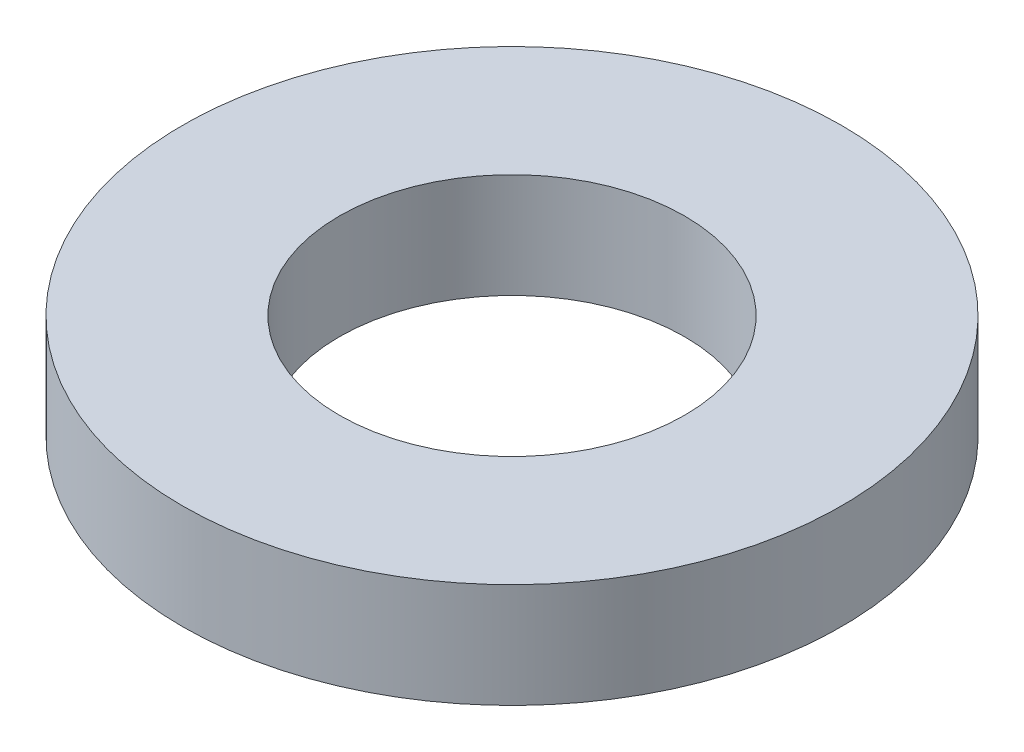
ISO-10303-21;
HEADER;
FILE_DESCRIPTION(('STEP AP214'),'2;1');
FILE_NAME('part.step','',(''),(''),'','','');
FILE_SCHEMA(('AUTOMOTIVE_DESIGN { 1 0 10303 214 1 1 1 1 }'));
ENDSEC;
DATA;
#1=APPLICATION_CONTEXT('core data for automotive mechanical design processes');
#2=APPLICATION_PROTOCOL_DEFINITION('international standard','automotive_design',2000,#1);
#3=PRODUCT_CONTEXT('',#1,'mechanical');
#4=PRODUCT('Part','Part','',(#3));
#5=PRODUCT_RELATED_PRODUCT_CATEGORY('part','',(#4));
#6=PRODUCT_DEFINITION_FORMATION('','',#4);
#7=PRODUCT_DEFINITION_CONTEXT('part definition',#1,'design');
#8=PRODUCT_DEFINITION('design','',#6,#7);
#9=PRODUCT_DEFINITION_SHAPE('','',#8);
#10=(LENGTH_UNIT() NAMED_UNIT(*) SI_UNIT(.MILLI.,.METRE.));
#11=(NAMED_UNIT(*) PLANE_ANGLE_UNIT() SI_UNIT($,.RADIAN.));
#12=(NAMED_UNIT(*) SI_UNIT($,.STERADIAN.) SOLID_ANGLE_UNIT());
#13=UNCERTAINTY_MEASURE_WITH_UNIT(LENGTH_MEASURE(1.E-05),#10,'distance_accuracy_value','');
#14=(GEOMETRIC_REPRESENTATION_CONTEXT(3) GLOBAL_UNCERTAINTY_ASSIGNED_CONTEXT((#13)) GLOBAL_UNIT_ASSIGNED_CONTEXT((#10,
#11,#12)) REPRESENTATION_CONTEXT('',''));
#15=CARTESIAN_POINT('',(0.,0.,0.));
#16=DIRECTION('',(0.,0.,1.));
#17=DIRECTION('',(1.,0.,0.));
#18=AXIS2_PLACEMENT_3D('',#15,#16,#17);
#19=CARTESIAN_POINT('',(0.,10.,0.));
#20=DIRECTION('',(0.,1.,0.));
#21=DIRECTION('',(0.,0.,1.));
#22=AXIS2_PLACEMENT_3D('',#19,#20,#21);
#23=PLANE('',#22);
#24=CARTESIAN_POINT('',(0.,10.,0.));
#25=DIRECTION('',(0.,1.,0.));
#26=DIRECTION('',(0.,0.,1.));
#27=AXIS2_PLACEMENT_3D('',#24,#25,#26);
#28=CIRCLE('',#27,31.5);
#29=CARTESIAN_POINT('',(0.,10.,31.5));
#30=VERTEX_POINT('',#29);
#31=EDGE_CURVE('E10',#30,#30,#28,.T.);
#32=ORIENTED_EDGE('',*,*,#31,.T.);
#33=EDGE_LOOP('',(#32));
#34=FACE_BOUND('',#33,.T.);
#35=CARTESIAN_POINT('',(0.,10.,0.));
#36=DIRECTION('',(0.,1.,0.));
#37=DIRECTION('',(0.,0.,1.));
#38=AXIS2_PLACEMENT_3D('',#35,#36,#37);
#39=CIRCLE('',#38,16.5);
#40=CARTESIAN_POINT('',(0.,10.,16.5));
#41=VERTEX_POINT('',#40);
#42=EDGE_CURVE('E46',#41,#41,#39,.T.);
#43=ORIENTED_EDGE('',*,*,#42,.F.);
#44=EDGE_LOOP('',(#43));
#45=FACE_BOUND('',#44,.T.);
#46=ADVANCED_FACE('F35',(#34,#45),#23,.T.);
#47=CARTESIAN_POINT('',(0.,0.,0.));
#48=DIRECTION('',(0.,1.,0.));
#49=DIRECTION('',(0.,0.,1.));
#50=AXIS2_PLACEMENT_3D('',#47,#48,#49);
#51=PLANE('',#50);
#52=CARTESIAN_POINT('',(0.,0.,0.));
#53=DIRECTION('',(0.,1.,0.));
#54=DIRECTION('',(0.,0.,1.));
#55=AXIS2_PLACEMENT_3D('',#52,#53,#54);
#56=CIRCLE('',#55,31.5);
#57=CARTESIAN_POINT('',(0.,0.,31.5));
#58=VERTEX_POINT('',#57);
#59=EDGE_CURVE('E39',#58,#58,#56,.T.);
#60=ORIENTED_EDGE('',*,*,#59,.F.);
#61=EDGE_LOOP('',(#60));
#62=FACE_BOUND('',#61,.T.);
#63=CARTESIAN_POINT('',(0.,0.,0.));
#64=DIRECTION('',(0.,1.,0.));
#65=DIRECTION('',(0.,0.,1.));
#66=AXIS2_PLACEMENT_3D('',#63,#64,#65);
#67=CIRCLE('',#66,16.5);
#68=CARTESIAN_POINT('',(0.,0.,16.5));
#69=VERTEX_POINT('',#68);
#70=EDGE_CURVE('E48',#69,#69,#67,.T.);
#71=ORIENTED_EDGE('',*,*,#70,.T.);
#72=EDGE_LOOP('',(#71));
#73=FACE_BOUND('',#72,.T.);
#74=ADVANCED_FACE('F58',(#62,#73),#51,.F.);
#75=CARTESIAN_POINT('',(0.,10.,0.));
#76=DIRECTION('',(0.,-1.,0.));
#77=DIRECTION('',(0.,0.,-1.));
#78=AXIS2_PLACEMENT_3D('',#75,#76,#77);
#79=CYLINDRICAL_SURFACE('',#78,31.5);
#80=ORIENTED_EDGE('',*,*,#31,.F.);
#81=EDGE_LOOP('',(#80));
#82=FACE_BOUND('',#81,.T.);
#83=ORIENTED_EDGE('',*,*,#59,.T.);
#84=EDGE_LOOP('',(#83));
#85=FACE_BOUND('',#84,.T.);
#86=ADVANCED_FACE('F37',(#82,#85),#79,.T.);
#87=CARTESIAN_POINT('',(0.,10.,0.));
#88=DIRECTION('',(0.,-1.,0.));
#89=DIRECTION('',(0.,0.,-1.));
#90=AXIS2_PLACEMENT_3D('',#87,#88,#89);
#91=CYLINDRICAL_SURFACE('',#90,16.5);
#92=ORIENTED_EDGE('',*,*,#42,.T.);
#93=EDGE_LOOP('',(#92));
#94=FACE_BOUND('',#93,.T.);
#95=ORIENTED_EDGE('',*,*,#70,.F.);
#96=EDGE_LOOP('',(#95));
#97=FACE_BOUND('',#96,.T.);
#98=ADVANCED_FACE('F54',(#94,#97),#91,.F.);
#99=CLOSED_SHELL('',(#46,#74,#86,#98));
#100=MANIFOLD_SOLID_BREP('B2',#99);
#101=ADVANCED_BREP_SHAPE_REPRESENTATION('',(#18,#100),#14);
#102=SHAPE_DEFINITION_REPRESENTATION(#9,#101);
ENDSEC;
END-ISO-10303-21;
